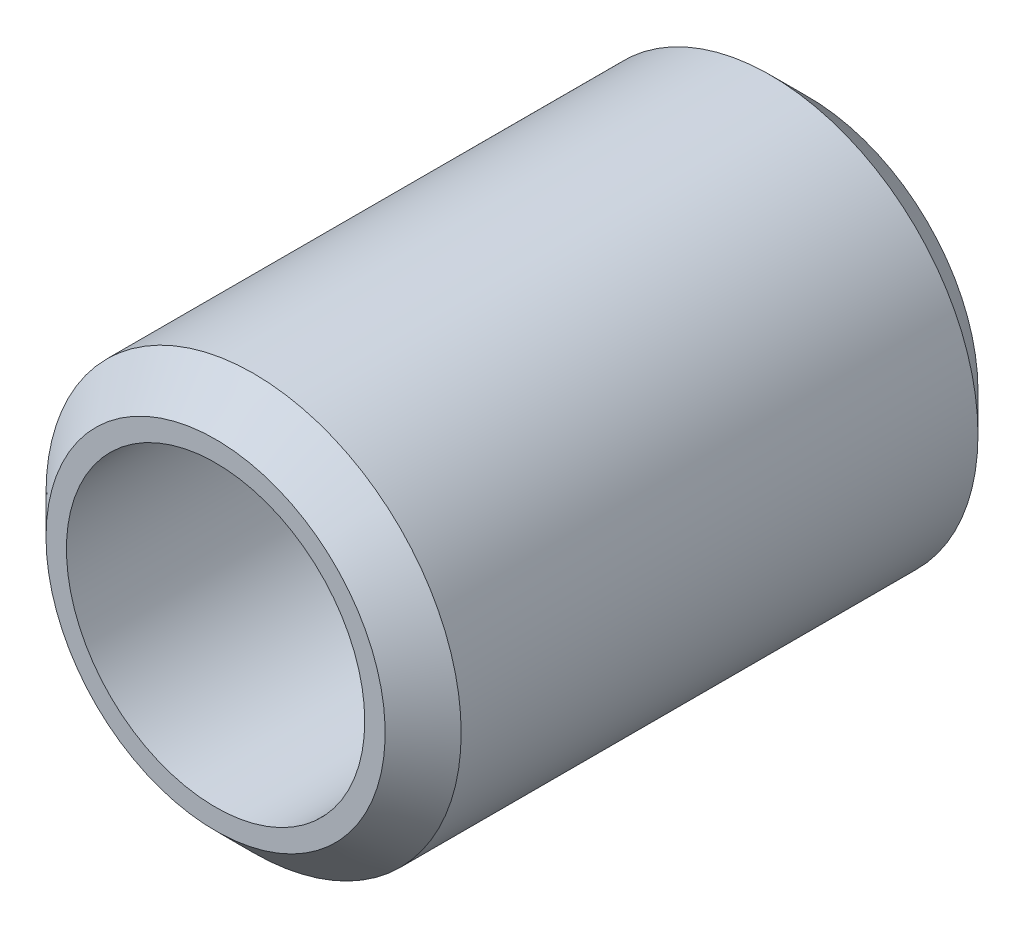
ISO-10303-21;
HEADER;
FILE_DESCRIPTION(('STEP AP214'),'2;1');
FILE_NAME('part.step','',(''),(''),'','','');
FILE_SCHEMA(('AUTOMOTIVE_DESIGN { 1 0 10303 214 1 1 1 1 }'));
ENDSEC;
DATA;
#1=APPLICATION_CONTEXT('core data for automotive mechanical design processes');
#2=APPLICATION_PROTOCOL_DEFINITION('international standard','automotive_design',2000,#1);
#3=PRODUCT_CONTEXT('',#1,'mechanical');
#4=PRODUCT('Part','Part','',(#3));
#5=PRODUCT_RELATED_PRODUCT_CATEGORY('part','',(#4));
#6=PRODUCT_DEFINITION_FORMATION('','',#4);
#7=PRODUCT_DEFINITION_CONTEXT('part definition',#1,'design');
#8=PRODUCT_DEFINITION('design','',#6,#7);
#9=PRODUCT_DEFINITION_SHAPE('','',#8);
#10=(LENGTH_UNIT() NAMED_UNIT(*) SI_UNIT(.MILLI.,.METRE.));
#11=(NAMED_UNIT(*) PLANE_ANGLE_UNIT() SI_UNIT($,.RADIAN.));
#12=(NAMED_UNIT(*) SI_UNIT($,.STERADIAN.) SOLID_ANGLE_UNIT());
#13=UNCERTAINTY_MEASURE_WITH_UNIT(LENGTH_MEASURE(1.E-05),#10,'distance_accuracy_value','');
#14=(GEOMETRIC_REPRESENTATION_CONTEXT(3) GLOBAL_UNCERTAINTY_ASSIGNED_CONTEXT((#13)) GLOBAL_UNIT_ASSIGNED_CONTEXT((#10,
#11,#12)) REPRESENTATION_CONTEXT('',''));
#15=CARTESIAN_POINT('',(0.,0.,0.));
#16=DIRECTION('',(0.,0.,1.));
#17=DIRECTION('',(1.,0.,0.));
#18=AXIS2_PLACEMENT_3D('',#15,#16,#17);
#19=CARTESIAN_POINT('',(0.,0.,-3.9624));
#20=DIRECTION('',(0.,0.,1.));
#21=DIRECTION('',(1.,0.,0.));
#22=AXIS2_PLACEMENT_3D('',#19,#20,#21);
#23=CYLINDRICAL_SURFACE('',#22,1.9939);
#24=CARTESIAN_POINT('',(0.,0.,3.9624));
#25=DIRECTION('',(0.,0.,1.));
#26=DIRECTION('',(1.,0.,0.));
#27=AXIS2_PLACEMENT_3D('',#24,#25,#26);
#28=CIRCLE('',#27,1.9939);
#29=CARTESIAN_POINT('',(1.9939,0.,3.9624));
#30=VERTEX_POINT('',#29);
#31=EDGE_CURVE('E18',#30,#30,#28,.F.);
#32=ORIENTED_EDGE('',*,*,#31,.F.);
#33=EDGE_LOOP('',(#32));
#34=FACE_BOUND('',#33,.T.);
#35=CARTESIAN_POINT('',(0.,0.,-3.9624));
#36=DIRECTION('',(0.,0.,1.));
#37=DIRECTION('',(1.,0.,0.));
#38=AXIS2_PLACEMENT_3D('',#35,#36,#37);
#39=CIRCLE('',#38,1.9939);
#40=CARTESIAN_POINT('',(1.9939,0.,-3.9624));
#41=VERTEX_POINT('',#40);
#42=EDGE_CURVE('E38',#41,#41,#39,.T.);
#43=ORIENTED_EDGE('',*,*,#42,.F.);
#44=EDGE_LOOP('',(#43));
#45=FACE_BOUND('',#44,.T.);
#46=ADVANCED_FACE('F15',(#34,#45),#23,.F.);
#47=CARTESIAN_POINT('',(0.,2.26695,3.9624));
#48=DIRECTION('',(0.,0.,1.));
#49=DIRECTION('',(1.,0.,0.));
#50=AXIS2_PLACEMENT_3D('',#47,#48,#49);
#51=PLANE('',#50);
#52=CARTESIAN_POINT('',(0.,0.,3.96240000003445));
#53=DIRECTION('',(0.,0.,-1.));
#54=DIRECTION('',(-1.,0.,0.));
#55=AXIS2_PLACEMENT_3D('',#52,#53,#54);
#56=CIRCLE('',#55,2.26695000003474);
#57=CARTESIAN_POINT('',(-2.26695000003474,0.,3.96240000003445));
#58=VERTEX_POINT('',#57);
#59=EDGE_CURVE('E36',#58,#58,#56,.T.);
#60=ORIENTED_EDGE('',*,*,#59,.F.);
#61=EDGE_LOOP('',(#60));
#62=FACE_BOUND('',#61,.T.);
#63=ORIENTED_EDGE('',*,*,#31,.T.);
#64=EDGE_LOOP('',(#63));
#65=FACE_BOUND('',#64,.T.);
#66=ADVANCED_FACE('F45',(#62,#65),#51,.T.);
#67=CARTESIAN_POINT('',(0.,1.9939,-3.9624));
#68=DIRECTION('',(0.,0.,-1.));
#69=DIRECTION('',(-1.,0.,0.));
#70=AXIS2_PLACEMENT_3D('',#67,#68,#69);
#71=PLANE('',#70);
#72=ORIENTED_EDGE('',*,*,#42,.T.);
#73=EDGE_LOOP('',(#72));
#74=FACE_BOUND('',#73,.T.);
#75=CARTESIAN_POINT('',(0.,0.,-3.96239999997761));
#76=DIRECTION('',(0.,0.,1.));
#77=DIRECTION('',(1.,0.,0.));
#78=AXIS2_PLACEMENT_3D('',#75,#76,#77);
#79=CIRCLE('',#78,2.2669499999779);
#80=CARTESIAN_POINT('',(2.2669499999779,0.,-3.96239999997761));
#81=VERTEX_POINT('',#80);
#82=EDGE_CURVE('E27',#81,#81,#79,.T.);
#83=ORIENTED_EDGE('',*,*,#82,.F.);
#84=EDGE_LOOP('',(#83));
#85=FACE_BOUND('',#84,.T.);
#86=ADVANCED_FACE('F53',(#74,#85),#71,.T.);
#87=CARTESIAN_POINT('',(0.,0.,3.45440000018016));
#88=DIRECTION('',(0.,0.,-1.));
#89=DIRECTION('',(-1.,0.,0.));
#90=AXIS2_PLACEMENT_3D('',#87,#88,#89);
#91=CONICAL_SURFACE('',#90,2.77494999994587,0.785398163453397);
#92=CARTESIAN_POINT('',(0.,0.,3.4544));
#93=DIRECTION('',(0.,0.,1.));
#94=DIRECTION('',(1.,0.,0.));
#95=AXIS2_PLACEMENT_3D('',#92,#93,#94);
#96=CIRCLE('',#95,2.77495);
#97=CARTESIAN_POINT('',(2.77495,0.,3.4544));
#98=VERTEX_POINT('',#97);
#99=EDGE_CURVE('E22',#98,#98,#96,.F.);
#100=ORIENTED_EDGE('',*,*,#99,.F.);
#101=EDGE_LOOP('',(#100));
#102=FACE_BOUND('',#101,.T.);
#103=ORIENTED_EDGE('',*,*,#59,.T.);
#104=EDGE_LOOP('',(#103));
#105=FACE_BOUND('',#104,.T.);
#106=ADVANCED_FACE('F62',(#102,#105),#91,.T.);
#107=CARTESIAN_POINT('',(0.,0.,-3.45440000000963));
#108=DIRECTION('',(0.,0.,1.));
#109=DIRECTION('',(1.,0.,0.));
#110=AXIS2_PLACEMENT_3D('',#107,#108,#109);
#111=CONICAL_SURFACE('',#110,2.77494999994587,0.785398163397448);
#112=ORIENTED_EDGE('',*,*,#82,.T.);
#113=EDGE_LOOP('',(#112));
#114=FACE_BOUND('',#113,.T.);
#115=CARTESIAN_POINT('',(0.,0.,-3.4544));
#116=DIRECTION('',(0.,0.,1.));
#117=DIRECTION('',(1.,0.,0.));
#118=AXIS2_PLACEMENT_3D('',#115,#116,#117);
#119=CIRCLE('',#118,2.77495);
#120=CARTESIAN_POINT('',(2.77495,0.,-3.4544));
#121=VERTEX_POINT('',#120);
#122=EDGE_CURVE('E10',#121,#121,#119,.T.);
#123=ORIENTED_EDGE('',*,*,#122,.F.);
#124=EDGE_LOOP('',(#123));
#125=FACE_BOUND('',#124,.T.);
#126=ADVANCED_FACE('F57',(#114,#125),#111,.T.);
#127=CARTESIAN_POINT('',(0.,0.,-3.9624));
#128=DIRECTION('',(0.,0.,1.));
#129=DIRECTION('',(1.,0.,0.));
#130=AXIS2_PLACEMENT_3D('',#127,#128,#129);
#131=CYLINDRICAL_SURFACE('',#130,2.77495);
#132=ORIENTED_EDGE('',*,*,#122,.T.);
#133=EDGE_LOOP('',(#132));
#134=FACE_BOUND('',#133,.T.);
#135=ORIENTED_EDGE('',*,*,#99,.T.);
#136=EDGE_LOOP('',(#135));
#137=FACE_BOUND('',#136,.T.);
#138=ADVANCED_FACE('F55',(#134,#137),#131,.T.);
#139=CLOSED_SHELL('',(#46,#66,#86,#106,#126,#138));
#140=MANIFOLD_SOLID_BREP('B1',#139);
#141=ADVANCED_BREP_SHAPE_REPRESENTATION('',(#18,#140),#14);
#142=SHAPE_DEFINITION_REPRESENTATION(#9,#141);
ENDSEC;
END-ISO-10303-21;
